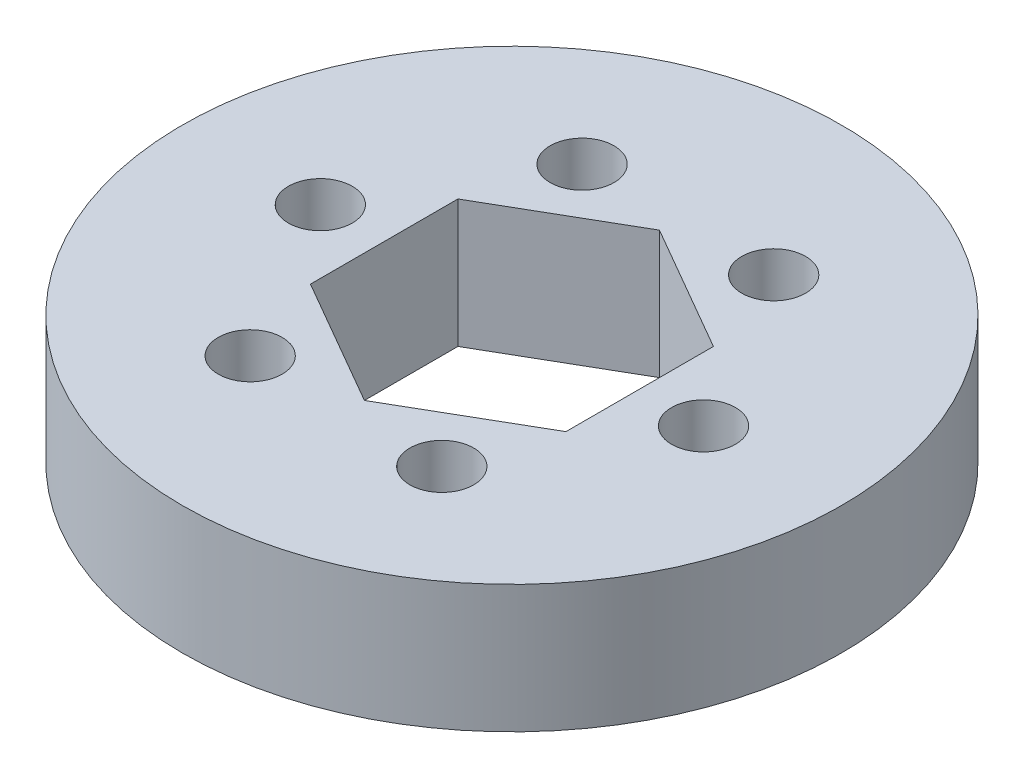
ISO-10303-21;
HEADER;
FILE_DESCRIPTION(('STEP AP214'),'2;1');
FILE_NAME('part.step','',(''),(''),'','','');
FILE_SCHEMA(('AUTOMOTIVE_DESIGN { 1 0 10303 214 1 1 1 1 }'));
ENDSEC;
DATA;
#1=APPLICATION_CONTEXT('core data for automotive mechanical design processes');
#2=APPLICATION_PROTOCOL_DEFINITION('international standard','automotive_design',2000,#1);
#3=PRODUCT_CONTEXT('',#1,'mechanical');
#4=PRODUCT('Part','Part','',(#3));
#5=PRODUCT_RELATED_PRODUCT_CATEGORY('part','',(#4));
#6=PRODUCT_DEFINITION_FORMATION('','',#4);
#7=PRODUCT_DEFINITION_CONTEXT('part definition',#1,'design');
#8=PRODUCT_DEFINITION('design','',#6,#7);
#9=PRODUCT_DEFINITION_SHAPE('','',#8);
#10=(LENGTH_UNIT() NAMED_UNIT(*) SI_UNIT(.MILLI.,.METRE.));
#11=(NAMED_UNIT(*) PLANE_ANGLE_UNIT() SI_UNIT($,.RADIAN.));
#12=(NAMED_UNIT(*) SI_UNIT($,.STERADIAN.) SOLID_ANGLE_UNIT());
#13=UNCERTAINTY_MEASURE_WITH_UNIT(LENGTH_MEASURE(1.E-05),#10,'distance_accuracy_value','');
#14=(GEOMETRIC_REPRESENTATION_CONTEXT(3) GLOBAL_UNCERTAINTY_ASSIGNED_CONTEXT((#13)) GLOBAL_UNIT_ASSIGNED_CONTEXT((#10,
#11,#12)) REPRESENTATION_CONTEXT('',''));
#15=CARTESIAN_POINT('',(0.,0.,0.));
#16=DIRECTION('',(0.,0.,1.));
#17=DIRECTION('',(1.,0.,0.));
#18=AXIS2_PLACEMENT_3D('',#15,#16,#17);
#19=CARTESIAN_POINT('',(0.,6.35,0.));
#20=DIRECTION('',(0.,1.,0.));
#21=DIRECTION('',(0.,0.,1.));
#22=AXIS2_PLACEMENT_3D('',#19,#20,#21);
#23=PLANE('',#22);
#24=CARTESIAN_POINT('',(9.525,6.35,0.));
#25=DIRECTION('',(0.,1.,0.));
#26=DIRECTION('',(0.,0.,1.));
#27=AXIS2_PLACEMENT_3D('',#24,#25,#26);
#28=CIRCLE('',#27,1.5875);
#29=CARTESIAN_POINT('',(9.525,6.35,1.5875));
#30=VERTEX_POINT('',#29);
#31=EDGE_CURVE('E293',#30,#30,#28,.T.);
#32=ORIENTED_EDGE('',*,*,#31,.F.);
#33=EDGE_LOOP('',(#32));
#34=FACE_BOUND('',#33,.T.);
#35=CARTESIAN_POINT('',(4.7625000000001,6.35,-8.24889197104672));
#36=DIRECTION('',(0.,1.,0.));
#37=DIRECTION('',(0.,0.,1.));
#38=AXIS2_PLACEMENT_3D('',#35,#36,#37);
#39=CIRCLE('',#38,1.5875);
#40=CARTESIAN_POINT('',(4.7625000000001,6.35,-6.66139197104672));
#41=VERTEX_POINT('',#40);
#42=EDGE_CURVE('E300',#41,#41,#39,.T.);
#43=ORIENTED_EDGE('',*,*,#42,.F.);
#44=EDGE_LOOP('',(#43));
#45=FACE_BOUND('',#44,.T.);
#46=CARTESIAN_POINT('',(-4.76249999999992,6.35,-8.24889197104682));
#47=DIRECTION('',(0.,1.,0.));
#48=DIRECTION('',(0.,0.,1.));
#49=AXIS2_PLACEMENT_3D('',#46,#47,#48);
#50=CIRCLE('',#49,1.5875);
#51=CARTESIAN_POINT('',(-4.76249999999992,6.35,-6.66139197104682));
#52=VERTEX_POINT('',#51);
#53=EDGE_CURVE('E306',#52,#52,#50,.T.);
#54=ORIENTED_EDGE('',*,*,#53,.F.);
#55=EDGE_LOOP('',(#54));
#56=FACE_BOUND('',#55,.T.);
#57=CARTESIAN_POINT('',(-9.525,6.35,0.));
#58=DIRECTION('',(0.,1.,0.));
#59=DIRECTION('',(0.,0.,1.));
#60=AXIS2_PLACEMENT_3D('',#57,#58,#59);
#61=CIRCLE('',#60,1.5875);
#62=CARTESIAN_POINT('',(-9.525,6.35,1.58749999999993));
#63=VERTEX_POINT('',#62);
#64=EDGE_CURVE('E319',#63,#63,#61,.T.);
#65=ORIENTED_EDGE('',*,*,#64,.F.);
#66=EDGE_LOOP('',(#65));
#67=FACE_BOUND('',#66,.T.);
#68=CARTESIAN_POINT('',(-4.76250000000004,6.35,8.24889197104676));
#69=DIRECTION('',(0.,1.,0.));
#70=DIRECTION('',(0.,0.,1.));
#71=AXIS2_PLACEMENT_3D('',#68,#69,#70);
#72=CIRCLE('',#71,1.5875);
#73=CARTESIAN_POINT('',(-4.76250000000004,6.35,9.83639197104676));
#74=VERTEX_POINT('',#73);
#75=EDGE_CURVE('E313',#74,#74,#72,.T.);
#76=ORIENTED_EDGE('',*,*,#75,.F.);
#77=EDGE_LOOP('',(#76));
#78=FACE_BOUND('',#77,.T.);
#79=CARTESIAN_POINT('',(4.76249999999998,6.35,8.24889197104679));
#80=DIRECTION('',(0.,1.,0.));
#81=DIRECTION('',(0.,0.,1.));
#82=AXIS2_PLACEMENT_3D('',#79,#80,#81);
#83=CIRCLE('',#82,1.5875);
#84=CARTESIAN_POINT('',(4.76249999999998,6.35,9.83639197104679));
#85=VERTEX_POINT('',#84);
#86=EDGE_CURVE('E307',#85,#85,#83,.T.);
#87=ORIENTED_EDGE('',*,*,#86,.F.);
#88=EDGE_LOOP('',(#87));
#89=FACE_BOUND('',#88,.T.);
#90=CARTESIAN_POINT('',(0.,6.35,0.));
#91=DIRECTION('',(0.,1.,0.));
#92=DIRECTION('',(0.,0.,1.));
#93=AXIS2_PLACEMENT_3D('',#90,#91,#92);
#94=CIRCLE('',#93,16.383);
#95=CARTESIAN_POINT('',(0.,6.35,16.383));
#96=VERTEX_POINT('',#95);
#97=EDGE_CURVE('E12',#96,#96,#94,.T.);
#98=ORIENTED_EDGE('',*,*,#97,.T.);
#99=EDGE_LOOP('',(#98));
#100=FACE_BOUND('',#99,.T.);
#101=DIRECTION('',(-0.866025403784437,0.,0.500000000000003));
#102=VECTOR('',#101,1.);
#103=CARTESIAN_POINT('',(0.,6.35,-7.33234841870825));
#104=LINE('',#103,#102);
#105=CARTESIAN_POINT('',(0.,6.35,-7.33234841870825));
#106=VERTEX_POINT('',#105);
#107=CARTESIAN_POINT('',(-6.35000000000003,6.35,-3.6661742093541));
#108=VERTEX_POINT('',#107);
#109=EDGE_CURVE('E103',#106,#108,#104,.T.);
#110=ORIENTED_EDGE('',*,*,#109,.F.);
#111=DIRECTION('',(-0.86602540378444,0.,-0.499999999999997));
#112=VECTOR('',#111,1.);
#113=CARTESIAN_POINT('',(6.35,6.35,-3.66617420935414));
#114=LINE('',#113,#112);
#115=CARTESIAN_POINT('',(6.35,6.35,-3.66617420935414));
#116=VERTEX_POINT('',#115);
#117=EDGE_CURVE('E95',#116,#106,#114,.T.);
#118=ORIENTED_EDGE('',*,*,#117,.F.);
#119=DIRECTION('',(0.,0.,-1.));
#120=VECTOR('',#119,1.);
#121=CARTESIAN_POINT('',(6.35000000000002,6.35,3.66617420935411));
#122=LINE('',#121,#120);
#123=CARTESIAN_POINT('',(6.35000000000002,6.35,3.66617420935411));
#124=VERTEX_POINT('',#123);
#125=EDGE_CURVE('E124',#124,#116,#122,.T.);
#126=ORIENTED_EDGE('',*,*,#125,.F.);
#127=DIRECTION('',(0.866025403784437,0.,-0.500000000000003));
#128=VECTOR('',#127,1.);
#129=CARTESIAN_POINT('',(0.,6.35,7.33234841870826));
#130=LINE('',#129,#128);
#131=CARTESIAN_POINT('',(0.,6.35,7.33234841870826));
#132=VERTEX_POINT('',#131);
#133=EDGE_CURVE('E122',#132,#124,#130,.T.);
#134=ORIENTED_EDGE('',*,*,#133,.F.);
#135=DIRECTION('',(0.866025403784441,0.,0.499999999999996));
#136=VECTOR('',#135,1.);
#137=CARTESIAN_POINT('',(-6.35000000000001,6.35,3.66617420935415));
#138=LINE('',#137,#136);
#139=CARTESIAN_POINT('',(-6.35000000000001,6.35,3.66617420935415));
#140=VERTEX_POINT('',#139);
#141=EDGE_CURVE('E117',#140,#132,#138,.T.);
#142=ORIENTED_EDGE('',*,*,#141,.F.);
#143=DIRECTION('',(0.,0.,1.));
#144=VECTOR('',#143,1.);
#145=CARTESIAN_POINT('',(-6.35000000000003,6.35,-3.6661742093541));
#146=LINE('',#145,#144);
#147=EDGE_CURVE('E115',#108,#140,#146,.T.);
#148=ORIENTED_EDGE('',*,*,#147,.F.);
#149=EDGE_LOOP('',(#110,#118,#126,#134,#142,#148));
#150=FACE_BOUND('',#149,.T.);
#151=ADVANCED_FACE('F41',(#34,#45,#56,#67,#78,#89,#100,#150),#23,.T.);
#152=CARTESIAN_POINT('',(0.,0.,0.));
#153=DIRECTION('',(0.,1.,0.));
#154=DIRECTION('',(0.,0.,1.));
#155=AXIS2_PLACEMENT_3D('',#152,#153,#154);
#156=PLANE('',#155);
#157=CARTESIAN_POINT('',(9.525,0.,0.));
#158=DIRECTION('',(0.,1.,0.));
#159=DIRECTION('',(0.,0.,1.));
#160=AXIS2_PLACEMENT_3D('',#157,#158,#159);
#161=CIRCLE('',#160,1.5875);
#162=CARTESIAN_POINT('',(9.525,0.,1.5875));
#163=VERTEX_POINT('',#162);
#164=EDGE_CURVE('E127',#163,#163,#161,.F.);
#165=ORIENTED_EDGE('',*,*,#164,.F.);
#166=EDGE_LOOP('',(#165));
#167=FACE_BOUND('',#166,.T.);
#168=CARTESIAN_POINT('',(4.7625000000001,0.,-8.24889197104672));
#169=DIRECTION('',(0.,1.,0.));
#170=DIRECTION('',(0.,0.,1.));
#171=AXIS2_PLACEMENT_3D('',#168,#169,#170);
#172=CIRCLE('',#171,1.5875);
#173=CARTESIAN_POINT('',(4.7625000000001,0.,-6.66139197104672));
#174=VERTEX_POINT('',#173);
#175=EDGE_CURVE('E303',#174,#174,#172,.F.);
#176=ORIENTED_EDGE('',*,*,#175,.F.);
#177=EDGE_LOOP('',(#176));
#178=FACE_BOUND('',#177,.T.);
#179=CARTESIAN_POINT('',(-4.76249999999992,0.,-8.24889197104682));
#180=DIRECTION('',(0.,1.,0.));
#181=DIRECTION('',(0.,0.,1.));
#182=AXIS2_PLACEMENT_3D('',#179,#180,#181);
#183=CIRCLE('',#182,1.5875);
#184=CARTESIAN_POINT('',(-4.76249999999992,0.,-6.66139197104682));
#185=VERTEX_POINT('',#184);
#186=EDGE_CURVE('E322',#185,#185,#183,.F.);
#187=ORIENTED_EDGE('',*,*,#186,.F.);
#188=EDGE_LOOP('',(#187));
#189=FACE_BOUND('',#188,.T.);
#190=CARTESIAN_POINT('',(-9.525,0.,0.));
#191=DIRECTION('',(0.,1.,0.));
#192=DIRECTION('',(0.,0.,1.));
#193=AXIS2_PLACEMENT_3D('',#190,#191,#192);
#194=CIRCLE('',#193,1.5875);
#195=CARTESIAN_POINT('',(-9.525,0.,1.58749999999993));
#196=VERTEX_POINT('',#195);
#197=EDGE_CURVE('E316',#196,#196,#194,.F.);
#198=ORIENTED_EDGE('',*,*,#197,.F.);
#199=EDGE_LOOP('',(#198));
#200=FACE_BOUND('',#199,.T.);
#201=CARTESIAN_POINT('',(-4.76250000000004,0.,8.24889197104676));
#202=DIRECTION('',(0.,1.,0.));
#203=DIRECTION('',(0.,0.,1.));
#204=AXIS2_PLACEMENT_3D('',#201,#202,#203);
#205=CIRCLE('',#204,1.5875);
#206=CARTESIAN_POINT('',(-4.76250000000004,0.,9.83639197104676));
#207=VERTEX_POINT('',#206);
#208=EDGE_CURVE('E310',#207,#207,#205,.F.);
#209=ORIENTED_EDGE('',*,*,#208,.F.);
#210=EDGE_LOOP('',(#209));
#211=FACE_BOUND('',#210,.T.);
#212=CARTESIAN_POINT('',(4.76249999999998,0.,8.24889197104679));
#213=DIRECTION('',(0.,1.,0.));
#214=DIRECTION('',(0.,0.,1.));
#215=AXIS2_PLACEMENT_3D('',#212,#213,#214);
#216=CIRCLE('',#215,1.5875);
#217=CARTESIAN_POINT('',(4.76249999999998,0.,9.83639197104679));
#218=VERTEX_POINT('',#217);
#219=EDGE_CURVE('E297',#218,#218,#216,.F.);
#220=ORIENTED_EDGE('',*,*,#219,.F.);
#221=EDGE_LOOP('',(#220));
#222=FACE_BOUND('',#221,.T.);
#223=CARTESIAN_POINT('',(0.,0.,0.));
#224=DIRECTION('',(0.,1.,0.));
#225=DIRECTION('',(0.,0.,1.));
#226=AXIS2_PLACEMENT_3D('',#223,#224,#225);
#227=CIRCLE('',#226,16.383);
#228=CARTESIAN_POINT('',(0.,0.,16.383));
#229=VERTEX_POINT('',#228);
#230=EDGE_CURVE('E45',#229,#229,#227,.T.);
#231=ORIENTED_EDGE('',*,*,#230,.F.);
#232=EDGE_LOOP('',(#231));
#233=FACE_BOUND('',#232,.T.);
#234=DIRECTION('',(-0.86602540378444,0.,-0.499999999999997));
#235=VECTOR('',#234,1.);
#236=CARTESIAN_POINT('',(6.35,0.,-3.66617420935414));
#237=LINE('',#236,#235);
#238=CARTESIAN_POINT('',(6.35,0.,-3.66617420935414));
#239=VERTEX_POINT('',#238);
#240=CARTESIAN_POINT('',(0.,0.,-7.33234841870825));
#241=VERTEX_POINT('',#240);
#242=EDGE_CURVE('E65',#239,#241,#237,.T.);
#243=ORIENTED_EDGE('',*,*,#242,.T.);
#244=DIRECTION('',(-0.866025403784437,0.,0.500000000000003));
#245=VECTOR('',#244,1.);
#246=CARTESIAN_POINT('',(0.,0.,-7.33234841870825));
#247=LINE('',#246,#245);
#248=CARTESIAN_POINT('',(-6.35000000000003,0.,-3.6661742093541));
#249=VERTEX_POINT('',#248);
#250=EDGE_CURVE('E110',#241,#249,#247,.T.);
#251=ORIENTED_EDGE('',*,*,#250,.T.);
#252=DIRECTION('',(0.,0.,1.));
#253=VECTOR('',#252,1.);
#254=CARTESIAN_POINT('',(-6.35000000000003,0.,-3.6661742093541));
#255=LINE('',#254,#253);
#256=CARTESIAN_POINT('',(-6.35000000000001,0.,3.66617420935415));
#257=VERTEX_POINT('',#256);
#258=EDGE_CURVE('E129',#249,#257,#255,.T.);
#259=ORIENTED_EDGE('',*,*,#258,.T.);
#260=DIRECTION('',(0.866025403784441,0.,0.499999999999996));
#261=VECTOR('',#260,1.);
#262=CARTESIAN_POINT('',(-6.35000000000001,0.,3.66617420935415));
#263=LINE('',#262,#261);
#264=CARTESIAN_POINT('',(0.,0.,7.33234841870826));
#265=VERTEX_POINT('',#264);
#266=EDGE_CURVE('E131',#257,#265,#263,.T.);
#267=ORIENTED_EDGE('',*,*,#266,.T.);
#268=DIRECTION('',(0.866025403784437,0.,-0.500000000000003));
#269=VECTOR('',#268,1.);
#270=CARTESIAN_POINT('',(0.,0.,7.33234841870826));
#271=LINE('',#270,#269);
#272=CARTESIAN_POINT('',(6.35000000000002,0.,3.66617420935411));
#273=VERTEX_POINT('',#272);
#274=EDGE_CURVE('E136',#265,#273,#271,.T.);
#275=ORIENTED_EDGE('',*,*,#274,.T.);
#276=DIRECTION('',(0.,0.,-1.));
#277=VECTOR('',#276,1.);
#278=CARTESIAN_POINT('',(6.35000000000002,0.,3.66617420935411));
#279=LINE('',#278,#277);
#280=EDGE_CURVE('E104',#273,#239,#279,.T.);
#281=ORIENTED_EDGE('',*,*,#280,.T.);
#282=EDGE_LOOP('',(#243,#251,#259,#267,#275,#281));
#283=FACE_BOUND('',#282,.T.);
#284=ADVANCED_FACE('F153',(#167,#178,#189,#200,#211,#222,#233,#283),#156,.F.);
#285=CARTESIAN_POINT('',(0.,6.35,0.));
#286=DIRECTION('',(0.,-1.,0.));
#287=DIRECTION('',(0.,0.,-1.));
#288=AXIS2_PLACEMENT_3D('',#285,#286,#287);
#289=CYLINDRICAL_SURFACE('',#288,16.383);
#290=ORIENTED_EDGE('',*,*,#97,.F.);
#291=EDGE_LOOP('',(#290));
#292=FACE_BOUND('',#291,.T.);
#293=ORIENTED_EDGE('',*,*,#230,.T.);
#294=EDGE_LOOP('',(#293));
#295=FACE_BOUND('',#294,.T.);
#296=ADVANCED_FACE('F43',(#292,#295),#289,.T.);
#297=CARTESIAN_POINT('',(6.35,6.35,-3.66617420935414));
#298=DIRECTION('',(-0.499999999999997,0.,0.86602540378444));
#299=DIRECTION('',(0.86602540378444,0.,0.499999999999997));
#300=AXIS2_PLACEMENT_3D('',#297,#298,#299);
#301=PLANE('',#300);
#302=ORIENTED_EDGE('',*,*,#242,.F.);
#303=DIRECTION('',(0.,-1.,0.));
#304=VECTOR('',#303,1.);
#305=CARTESIAN_POINT('',(6.35,6.35,-3.66617420935414));
#306=LINE('',#305,#304);
#307=EDGE_CURVE('E99',#116,#239,#306,.T.);
#308=ORIENTED_EDGE('',*,*,#307,.F.);
#309=ORIENTED_EDGE('',*,*,#117,.T.);
#310=DIRECTION('',(0.,-1.,0.));
#311=VECTOR('',#310,1.);
#312=CARTESIAN_POINT('',(0.,6.35,-7.33234841870825));
#313=LINE('',#312,#311);
#314=EDGE_CURVE('E98',#106,#241,#313,.T.);
#315=ORIENTED_EDGE('',*,*,#314,.T.);
#316=EDGE_LOOP('',(#302,#308,#309,#315));
#317=FACE_BOUND('',#316,.T.);
#318=ADVANCED_FACE('F97',(#317),#301,.T.);
#319=CARTESIAN_POINT('',(0.,6.35,-7.33234841870825));
#320=DIRECTION('',(0.500000000000003,0.,0.866025403784437));
#321=DIRECTION('',(0.866025403784437,0.,-0.500000000000003));
#322=AXIS2_PLACEMENT_3D('',#319,#320,#321);
#323=PLANE('',#322);
#324=ORIENTED_EDGE('',*,*,#250,.F.);
#325=ORIENTED_EDGE('',*,*,#314,.F.);
#326=ORIENTED_EDGE('',*,*,#109,.T.);
#327=DIRECTION('',(0.,-1.,0.));
#328=VECTOR('',#327,1.);
#329=CARTESIAN_POINT('',(-6.35000000000003,6.35,-3.6661742093541));
#330=LINE('',#329,#328);
#331=EDGE_CURVE('E111',#108,#249,#330,.T.);
#332=ORIENTED_EDGE('',*,*,#331,.T.);
#333=EDGE_LOOP('',(#324,#325,#326,#332));
#334=FACE_BOUND('',#333,.T.);
#335=ADVANCED_FACE('F107',(#334),#323,.T.);
#336=CARTESIAN_POINT('',(-6.35000000000003,6.35,-3.6661742093541));
#337=DIRECTION('',(1.,0.,0.));
#338=DIRECTION('',(0.,0.,-1.));
#339=AXIS2_PLACEMENT_3D('',#336,#337,#338);
#340=PLANE('',#339);
#341=ORIENTED_EDGE('',*,*,#258,.F.);
#342=ORIENTED_EDGE('',*,*,#331,.F.);
#343=ORIENTED_EDGE('',*,*,#147,.T.);
#344=DIRECTION('',(0.,-1.,0.));
#345=VECTOR('',#344,1.);
#346=CARTESIAN_POINT('',(-6.35000000000001,6.35,3.66617420935415));
#347=LINE('',#346,#345);
#348=EDGE_CURVE('E145',#140,#257,#347,.T.);
#349=ORIENTED_EDGE('',*,*,#348,.T.);
#350=EDGE_LOOP('',(#341,#342,#343,#349));
#351=FACE_BOUND('',#350,.T.);
#352=ADVANCED_FACE('F149',(#351),#340,.T.);
#353=CARTESIAN_POINT('',(-6.35000000000001,6.35,3.66617420935415));
#354=DIRECTION('',(0.499999999999996,0.,-0.866025403784441));
#355=DIRECTION('',(-0.866025403784441,0.,-0.499999999999996));
#356=AXIS2_PLACEMENT_3D('',#353,#354,#355);
#357=PLANE('',#356);
#358=ORIENTED_EDGE('',*,*,#266,.F.);
#359=ORIENTED_EDGE('',*,*,#348,.F.);
#360=ORIENTED_EDGE('',*,*,#141,.T.);
#361=DIRECTION('',(0.,-1.,0.));
#362=VECTOR('',#361,1.);
#363=CARTESIAN_POINT('',(0.,6.35,7.33234841870826));
#364=LINE('',#363,#362);
#365=EDGE_CURVE('E143',#132,#265,#364,.T.);
#366=ORIENTED_EDGE('',*,*,#365,.T.);
#367=EDGE_LOOP('',(#358,#359,#360,#366));
#368=FACE_BOUND('',#367,.T.);
#369=ADVANCED_FACE('F161',(#368),#357,.T.);
#370=CARTESIAN_POINT('',(0.,6.35,7.33234841870826));
#371=DIRECTION('',(-0.500000000000003,0.,-0.866025403784437));
#372=DIRECTION('',(-0.866025403784437,0.,0.500000000000003));
#373=AXIS2_PLACEMENT_3D('',#370,#371,#372);
#374=PLANE('',#373);
#375=ORIENTED_EDGE('',*,*,#274,.F.);
#376=ORIENTED_EDGE('',*,*,#365,.F.);
#377=ORIENTED_EDGE('',*,*,#133,.T.);
#378=DIRECTION('',(0.,-1.,0.));
#379=VECTOR('',#378,1.);
#380=CARTESIAN_POINT('',(6.35000000000002,6.35,3.66617420935411));
#381=LINE('',#380,#379);
#382=EDGE_CURVE('E57',#124,#273,#381,.T.);
#383=ORIENTED_EDGE('',*,*,#382,.T.);
#384=EDGE_LOOP('',(#375,#376,#377,#383));
#385=FACE_BOUND('',#384,.T.);
#386=ADVANCED_FACE('F159',(#385),#374,.T.);
#387=CARTESIAN_POINT('',(6.35000000000002,6.35,3.66617420935411));
#388=DIRECTION('',(-1.,0.,0.));
#389=DIRECTION('',(0.,0.,1.));
#390=AXIS2_PLACEMENT_3D('',#387,#388,#389);
#391=PLANE('',#390);
#392=ORIENTED_EDGE('',*,*,#280,.F.);
#393=ORIENTED_EDGE('',*,*,#382,.F.);
#394=ORIENTED_EDGE('',*,*,#125,.T.);
#395=ORIENTED_EDGE('',*,*,#307,.T.);
#396=EDGE_LOOP('',(#392,#393,#394,#395));
#397=FACE_BOUND('',#396,.T.);
#398=ADVANCED_FACE('F155',(#397),#391,.T.);
#399=CARTESIAN_POINT('',(4.76249999999998,-0.00100000000000013,8.24889197104679));
#400=DIRECTION('',(0.,1.,0.));
#401=DIRECTION('',(0.,0.,1.));
#402=AXIS2_PLACEMENT_3D('',#399,#400,#401);
#403=CYLINDRICAL_SURFACE('',#402,1.5875);
#404=ORIENTED_EDGE('',*,*,#86,.T.);
#405=EDGE_LOOP('',(#404));
#406=FACE_BOUND('',#405,.T.);
#407=ORIENTED_EDGE('',*,*,#219,.T.);
#408=EDGE_LOOP('',(#407));
#409=FACE_BOUND('',#408,.T.);
#410=ADVANCED_FACE('F210',(#406,#409),#403,.F.);
#411=CARTESIAN_POINT('',(-4.76250000000004,-0.00100000000000013,8.24889197104676));
#412=DIRECTION('',(0.,1.,0.));
#413=DIRECTION('',(0.,0.,1.));
#414=AXIS2_PLACEMENT_3D('',#411,#412,#413);
#415=CYLINDRICAL_SURFACE('',#414,1.5875);
#416=ORIENTED_EDGE('',*,*,#75,.T.);
#417=EDGE_LOOP('',(#416));
#418=FACE_BOUND('',#417,.T.);
#419=ORIENTED_EDGE('',*,*,#208,.T.);
#420=EDGE_LOOP('',(#419));
#421=FACE_BOUND('',#420,.T.);
#422=ADVANCED_FACE('F232',(#418,#421),#415,.F.);
#423=CARTESIAN_POINT('',(-9.525,-0.00100000000000013,0.));
#424=DIRECTION('',(0.,1.,0.));
#425=DIRECTION('',(0.,0.,1.));
#426=AXIS2_PLACEMENT_3D('',#423,#424,#425);
#427=CYLINDRICAL_SURFACE('',#426,1.5875);
#428=ORIENTED_EDGE('',*,*,#64,.T.);
#429=EDGE_LOOP('',(#428));
#430=FACE_BOUND('',#429,.T.);
#431=ORIENTED_EDGE('',*,*,#197,.T.);
#432=EDGE_LOOP('',(#431));
#433=FACE_BOUND('',#432,.T.);
#434=ADVANCED_FACE('F243',(#430,#433),#427,.F.);
#435=CARTESIAN_POINT('',(-4.76249999999992,-0.00100000000000013,-8.24889197104682));
#436=DIRECTION('',(0.,1.,0.));
#437=DIRECTION('',(0.,0.,1.));
#438=AXIS2_PLACEMENT_3D('',#435,#436,#437);
#439=CYLINDRICAL_SURFACE('',#438,1.5875);
#440=ORIENTED_EDGE('',*,*,#53,.T.);
#441=EDGE_LOOP('',(#440));
#442=FACE_BOUND('',#441,.T.);
#443=ORIENTED_EDGE('',*,*,#186,.T.);
#444=EDGE_LOOP('',(#443));
#445=FACE_BOUND('',#444,.T.);
#446=ADVANCED_FACE('F253',(#442,#445),#439,.F.);
#447=CARTESIAN_POINT('',(4.7625000000001,-0.00100000000000013,-8.24889197104672));
#448=DIRECTION('',(0.,1.,0.));
#449=DIRECTION('',(0.,0.,1.));
#450=AXIS2_PLACEMENT_3D('',#447,#448,#449);
#451=CYLINDRICAL_SURFACE('',#450,1.5875);
#452=ORIENTED_EDGE('',*,*,#42,.T.);
#453=EDGE_LOOP('',(#452));
#454=FACE_BOUND('',#453,.T.);
#455=ORIENTED_EDGE('',*,*,#175,.T.);
#456=EDGE_LOOP('',(#455));
#457=FACE_BOUND('',#456,.T.);
#458=ADVANCED_FACE('F263',(#454,#457),#451,.F.);
#459=CARTESIAN_POINT('',(9.525,-0.00100000000000013,0.));
#460=DIRECTION('',(0.,1.,0.));
#461=DIRECTION('',(0.,0.,1.));
#462=AXIS2_PLACEMENT_3D('',#459,#460,#461);
#463=CYLINDRICAL_SURFACE('',#462,1.5875);
#464=ORIENTED_EDGE('',*,*,#31,.T.);
#465=EDGE_LOOP('',(#464));
#466=FACE_BOUND('',#465,.T.);
#467=ORIENTED_EDGE('',*,*,#164,.T.);
#468=EDGE_LOOP('',(#467));
#469=FACE_BOUND('',#468,.T.);
#470=ADVANCED_FACE('F273',(#466,#469),#463,.F.);
#471=CLOSED_SHELL('',(#151,#284,#296,#318,#335,#352,#369,#386,#398,#410,#422,#434,#446,#458,#470));
#472=MANIFOLD_SOLID_BREP('B2',#471);
#473=ADVANCED_BREP_SHAPE_REPRESENTATION('',(#18,#472),#14);
#474=SHAPE_DEFINITION_REPRESENTATION(#9,#473);
ENDSEC;
END-ISO-10303-21;
